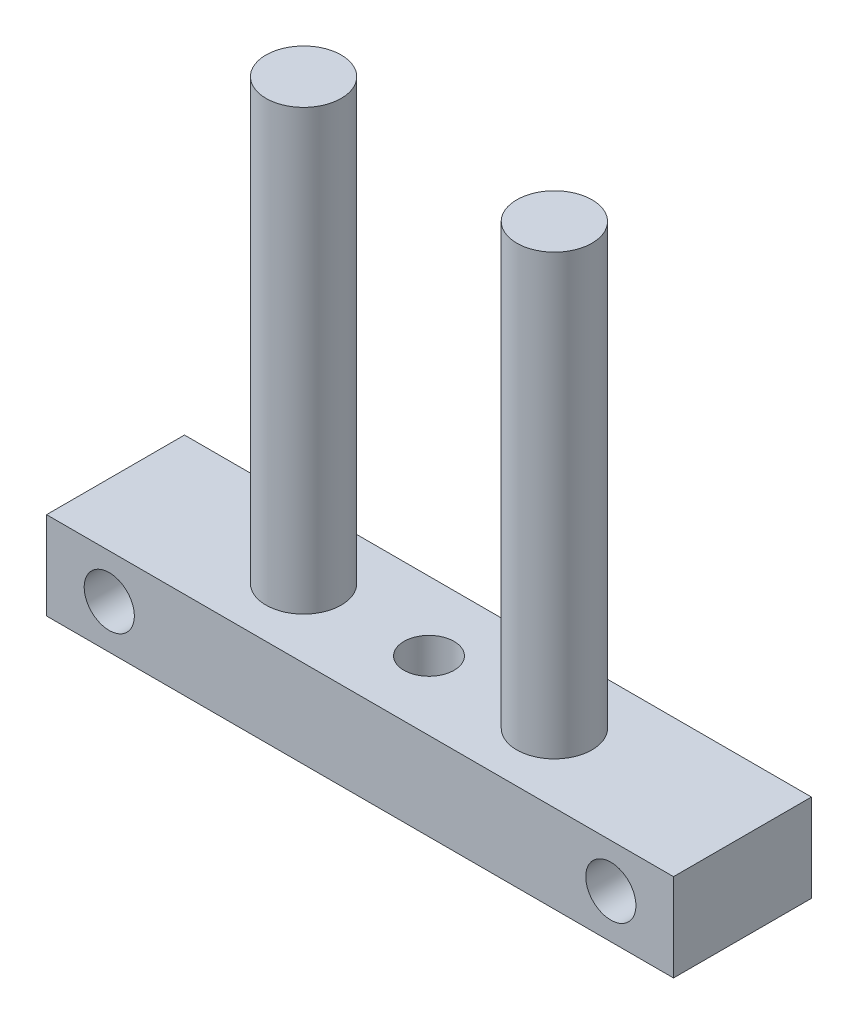
ISO-10303-21;
HEADER;
FILE_DESCRIPTION(('STEP AP214'),'2;1');
FILE_NAME('part.step','',(''),(''),'','','');
FILE_SCHEMA(('AUTOMOTIVE_DESIGN { 1 0 10303 214 1 1 1 1 }'));
ENDSEC;
DATA;
#1=APPLICATION_CONTEXT('core data for automotive mechanical design processes');
#2=APPLICATION_PROTOCOL_DEFINITION('international standard','automotive_design',2000,#1);
#3=PRODUCT_CONTEXT('',#1,'mechanical');
#4=PRODUCT('Part','Part','',(#3));
#5=PRODUCT_RELATED_PRODUCT_CATEGORY('part','',(#4));
#6=PRODUCT_DEFINITION_FORMATION('','',#4);
#7=PRODUCT_DEFINITION_CONTEXT('part definition',#1,'design');
#8=PRODUCT_DEFINITION('design','',#6,#7);
#9=PRODUCT_DEFINITION_SHAPE('','',#8);
#10=(LENGTH_UNIT() NAMED_UNIT(*) SI_UNIT(.MILLI.,.METRE.));
#11=(NAMED_UNIT(*) PLANE_ANGLE_UNIT() SI_UNIT($,.RADIAN.));
#12=(NAMED_UNIT(*) SI_UNIT($,.STERADIAN.) SOLID_ANGLE_UNIT());
#13=UNCERTAINTY_MEASURE_WITH_UNIT(LENGTH_MEASURE(1.E-05),#10,'distance_accuracy_value','');
#14=(GEOMETRIC_REPRESENTATION_CONTEXT(3) GLOBAL_UNCERTAINTY_ASSIGNED_CONTEXT((#13)) GLOBAL_UNIT_ASSIGNED_CONTEXT((#10,
#11,#12)) REPRESENTATION_CONTEXT('',''));
#15=CARTESIAN_POINT('',(0.,0.,0.));
#16=DIRECTION('',(0.,0.,1.));
#17=DIRECTION('',(1.,0.,0.));
#18=AXIS2_PLACEMENT_3D('',#15,#16,#17);
#19=CARTESIAN_POINT('',(25.,-3.5,11.));
#20=DIRECTION('',(-1.,0.,0.));
#21=DIRECTION('',(0.,0.,1.));
#22=AXIS2_PLACEMENT_3D('',#19,#20,#21);
#23=PLANE('',#22);
#24=DIRECTION('',(0.,1.,0.));
#25=VECTOR('',#24,1.);
#26=CARTESIAN_POINT('',(25.,-3.5,0.));
#27=LINE('',#26,#25);
#28=CARTESIAN_POINT('',(25.,-3.5,0.));
#29=VERTEX_POINT('',#28);
#30=CARTESIAN_POINT('',(25.,3.5,0.));
#31=VERTEX_POINT('',#30);
#32=EDGE_CURVE('E111',#29,#31,#27,.T.);
#33=ORIENTED_EDGE('',*,*,#32,.T.);
#34=DIRECTION('',(0.,0.,-1.));
#35=VECTOR('',#34,1.);
#36=CARTESIAN_POINT('',(25.,3.5,11.));
#37=LINE('',#36,#35);
#38=CARTESIAN_POINT('',(25.,3.5,11.));
#39=VERTEX_POINT('',#38);
#40=EDGE_CURVE('E100',#39,#31,#37,.T.);
#41=ORIENTED_EDGE('',*,*,#40,.F.);
#42=DIRECTION('',(0.,1.,0.));
#43=VECTOR('',#42,1.);
#44=CARTESIAN_POINT('',(25.,-3.5,11.));
#45=LINE('',#44,#43);
#46=CARTESIAN_POINT('',(25.,-3.5,11.));
#47=VERTEX_POINT('',#46);
#48=EDGE_CURVE('E92',#47,#39,#45,.T.);
#49=ORIENTED_EDGE('',*,*,#48,.F.);
#50=DIRECTION('',(0.,0.,-1.));
#51=VECTOR('',#50,1.);
#52=CARTESIAN_POINT('',(25.,-3.5,11.));
#53=LINE('',#52,#51);
#54=EDGE_CURVE('E107',#47,#29,#53,.T.);
#55=ORIENTED_EDGE('',*,*,#54,.T.);
#56=EDGE_LOOP('',(#33,#41,#49,#55));
#57=FACE_BOUND('',#56,.T.);
#58=ADVANCED_FACE('F39',(#57),#23,.F.);
#59=CARTESIAN_POINT('',(-25.,3.5,11.));
#60=DIRECTION('',(0.,-1.,0.));
#61=DIRECTION('',(0.,0.,-1.));
#62=AXIS2_PLACEMENT_3D('',#59,#60,#61);
#63=PLANE('',#62);
#64=CARTESIAN_POINT('',(-9.99999999999999,3.5,5.5));
#65=DIRECTION('',(0.,-1.,0.));
#66=DIRECTION('',(0.,0.,-1.));
#67=AXIS2_PLACEMENT_3D('',#64,#65,#66);
#68=CIRCLE('',#67,3.);
#69=CARTESIAN_POINT('',(-9.99999999999999,3.5,2.5));
#70=VERTEX_POINT('',#69);
#71=EDGE_CURVE('E11',#70,#70,#68,.F.);
#72=ORIENTED_EDGE('',*,*,#71,.F.);
#73=EDGE_LOOP('',(#72));
#74=FACE_BOUND('',#73,.T.);
#75=CARTESIAN_POINT('',(9.99999999999999,3.5,5.49999999999999));
#76=DIRECTION('',(0.,-1.,0.));
#77=DIRECTION('',(0.,0.,-1.));
#78=AXIS2_PLACEMENT_3D('',#75,#76,#77);
#79=CIRCLE('',#78,3.);
#80=CARTESIAN_POINT('',(9.99999999999999,3.5,2.49999999999999));
#81=VERTEX_POINT('',#80);
#82=EDGE_CURVE('E48',#81,#81,#79,.F.);
#83=ORIENTED_EDGE('',*,*,#82,.F.);
#84=EDGE_LOOP('',(#83));
#85=FACE_BOUND('',#84,.T.);
#86=CARTESIAN_POINT('',(0.,3.5,5.5));
#87=DIRECTION('',(0.,-1.,0.));
#88=DIRECTION('',(0.,0.,-1.));
#89=AXIS2_PLACEMENT_3D('',#86,#87,#88);
#90=CIRCLE('',#89,2.);
#91=CARTESIAN_POINT('',(0.,3.5,3.5));
#92=VERTEX_POINT('',#91);
#93=EDGE_CURVE('E138',#92,#92,#90,.T.);
#94=ORIENTED_EDGE('',*,*,#93,.T.);
#95=EDGE_LOOP('',(#94));
#96=FACE_BOUND('',#95,.T.);
#97=DIRECTION('',(-1.,0.,0.));
#98=VECTOR('',#97,1.);
#99=CARTESIAN_POINT('',(-25.,3.5,0.));
#100=LINE('',#99,#98);
#101=CARTESIAN_POINT('',(-25.,3.5,0.));
#102=VERTEX_POINT('',#101);
#103=EDGE_CURVE('E98',#31,#102,#100,.T.);
#104=ORIENTED_EDGE('',*,*,#103,.T.);
#105=DIRECTION('',(0.,0.,-1.));
#106=VECTOR('',#105,1.);
#107=CARTESIAN_POINT('',(-25.,3.5,11.));
#108=LINE('',#107,#106);
#109=CARTESIAN_POINT('',(-25.,3.5,11.));
#110=VERTEX_POINT('',#109);
#111=EDGE_CURVE('E96',#110,#102,#108,.T.);
#112=ORIENTED_EDGE('',*,*,#111,.F.);
#113=DIRECTION('',(-1.,0.,0.));
#114=VECTOR('',#113,1.);
#115=CARTESIAN_POINT('',(-25.,3.5,11.));
#116=LINE('',#115,#114);
#117=EDGE_CURVE('E87',#39,#110,#116,.T.);
#118=ORIENTED_EDGE('',*,*,#117,.F.);
#119=ORIENTED_EDGE('',*,*,#40,.T.);
#120=EDGE_LOOP('',(#104,#112,#118,#119));
#121=FACE_BOUND('',#120,.T.);
#122=ADVANCED_FACE('F97',(#74,#85,#96,#121),#63,.F.);
#123=CARTESIAN_POINT('',(-25.,-3.5,11.));
#124=DIRECTION('',(1.,0.,0.));
#125=DIRECTION('',(0.,0.,-1.));
#126=AXIS2_PLACEMENT_3D('',#123,#124,#125);
#127=PLANE('',#126);
#128=DIRECTION('',(0.,-1.,0.));
#129=VECTOR('',#128,1.);
#130=CARTESIAN_POINT('',(-25.,-3.5,0.));
#131=LINE('',#130,#129);
#132=CARTESIAN_POINT('',(-25.,-3.5,0.));
#133=VERTEX_POINT('',#132);
#134=EDGE_CURVE('E73',#102,#133,#131,.T.);
#135=ORIENTED_EDGE('',*,*,#134,.T.);
#136=DIRECTION('',(0.,0.,-1.));
#137=VECTOR('',#136,1.);
#138=CARTESIAN_POINT('',(-25.,-3.5,11.));
#139=LINE('',#138,#137);
#140=CARTESIAN_POINT('',(-25.,-3.5,11.));
#141=VERTEX_POINT('',#140);
#142=EDGE_CURVE('E101',#141,#133,#139,.T.);
#143=ORIENTED_EDGE('',*,*,#142,.F.);
#144=DIRECTION('',(0.,-1.,0.));
#145=VECTOR('',#144,1.);
#146=CARTESIAN_POINT('',(-25.,-3.5,11.));
#147=LINE('',#146,#145);
#148=EDGE_CURVE('E90',#110,#141,#147,.T.);
#149=ORIENTED_EDGE('',*,*,#148,.F.);
#150=ORIENTED_EDGE('',*,*,#111,.T.);
#151=EDGE_LOOP('',(#135,#143,#149,#150));
#152=FACE_BOUND('',#151,.T.);
#153=ADVANCED_FACE('F103',(#152),#127,.F.);
#154=CARTESIAN_POINT('',(-25.,-3.5,11.));
#155=DIRECTION('',(0.,1.,0.));
#156=DIRECTION('',(0.,0.,1.));
#157=AXIS2_PLACEMENT_3D('',#154,#155,#156);
#158=PLANE('',#157);
#159=CARTESIAN_POINT('',(0.,-3.5,5.5));
#160=DIRECTION('',(0.,-1.,0.));
#161=DIRECTION('',(0.,0.,-1.));
#162=AXIS2_PLACEMENT_3D('',#159,#160,#161);
#163=CIRCLE('',#162,2.);
#164=CARTESIAN_POINT('',(0.,-3.5,3.5));
#165=VERTEX_POINT('',#164);
#166=EDGE_CURVE('E142',#165,#165,#163,.T.);
#167=ORIENTED_EDGE('',*,*,#166,.F.);
#168=EDGE_LOOP('',(#167));
#169=FACE_BOUND('',#168,.T.);
#170=DIRECTION('',(1.,0.,0.));
#171=VECTOR('',#170,1.);
#172=CARTESIAN_POINT('',(-25.,-3.5,0.));
#173=LINE('',#172,#171);
#174=EDGE_CURVE('E79',#133,#29,#173,.T.);
#175=ORIENTED_EDGE('',*,*,#174,.T.);
#176=ORIENTED_EDGE('',*,*,#54,.F.);
#177=DIRECTION('',(1.,0.,0.));
#178=VECTOR('',#177,1.);
#179=CARTESIAN_POINT('',(-25.,-3.5,11.));
#180=LINE('',#179,#178);
#181=EDGE_CURVE('E56',#141,#47,#180,.T.);
#182=ORIENTED_EDGE('',*,*,#181,.F.);
#183=ORIENTED_EDGE('',*,*,#142,.T.);
#184=EDGE_LOOP('',(#175,#176,#182,#183));
#185=FACE_BOUND('',#184,.T.);
#186=ADVANCED_FACE('F182',(#169,#185),#158,.F.);
#187=CARTESIAN_POINT('',(0.,0.,11.));
#188=DIRECTION('',(0.,0.,-1.));
#189=DIRECTION('',(-1.,0.,0.));
#190=AXIS2_PLACEMENT_3D('',#187,#188,#189);
#191=PLANE('',#190);
#192=CARTESIAN_POINT('',(-20.,0.,11.));
#193=DIRECTION('',(0.,0.,-1.));
#194=DIRECTION('',(-1.,0.,0.));
#195=AXIS2_PLACEMENT_3D('',#192,#193,#194);
#196=CIRCLE('',#195,2.);
#197=CARTESIAN_POINT('',(-22.,0.,11.));
#198=VERTEX_POINT('',#197);
#199=EDGE_CURVE('E115',#198,#198,#196,.T.);
#200=ORIENTED_EDGE('',*,*,#199,.T.);
#201=EDGE_LOOP('',(#200));
#202=FACE_BOUND('',#201,.T.);
#203=CARTESIAN_POINT('',(20.,0.,11.));
#204=DIRECTION('',(0.,0.,-1.));
#205=DIRECTION('',(1.,0.,0.));
#206=AXIS2_PLACEMENT_3D('',#203,#204,#205);
#207=CIRCLE('',#206,2.);
#208=CARTESIAN_POINT('',(22.,0.,11.));
#209=VERTEX_POINT('',#208);
#210=EDGE_CURVE('E147',#209,#209,#207,.T.);
#211=ORIENTED_EDGE('',*,*,#210,.T.);
#212=EDGE_LOOP('',(#211));
#213=FACE_BOUND('',#212,.T.);
#214=ORIENTED_EDGE('',*,*,#48,.T.);
#215=ORIENTED_EDGE('',*,*,#117,.T.);
#216=ORIENTED_EDGE('',*,*,#148,.T.);
#217=ORIENTED_EDGE('',*,*,#181,.T.);
#218=EDGE_LOOP('',(#214,#215,#216,#217));
#219=FACE_BOUND('',#218,.T.);
#220=ADVANCED_FACE('F88',(#202,#213,#219),#191,.F.);
#221=CARTESIAN_POINT('',(0.,0.,0.));
#222=DIRECTION('',(0.,0.,-1.));
#223=DIRECTION('',(-1.,0.,0.));
#224=AXIS2_PLACEMENT_3D('',#221,#222,#223);
#225=PLANE('',#224);
#226=CARTESIAN_POINT('',(-20.,0.,0.));
#227=DIRECTION('',(0.,0.,-1.));
#228=DIRECTION('',(-1.,0.,0.));
#229=AXIS2_PLACEMENT_3D('',#226,#227,#228);
#230=CIRCLE('',#229,2.);
#231=CARTESIAN_POINT('',(-22.,0.,0.));
#232=VERTEX_POINT('',#231);
#233=EDGE_CURVE('E158',#232,#232,#230,.T.);
#234=ORIENTED_EDGE('',*,*,#233,.F.);
#235=EDGE_LOOP('',(#234));
#236=FACE_BOUND('',#235,.T.);
#237=CARTESIAN_POINT('',(20.,0.,0.));
#238=DIRECTION('',(0.,0.,-1.));
#239=DIRECTION('',(1.,0.,0.));
#240=AXIS2_PLACEMENT_3D('',#237,#238,#239);
#241=CIRCLE('',#240,2.);
#242=CARTESIAN_POINT('',(22.,0.,0.));
#243=VERTEX_POINT('',#242);
#244=EDGE_CURVE('E141',#243,#243,#241,.T.);
#245=ORIENTED_EDGE('',*,*,#244,.F.);
#246=EDGE_LOOP('',(#245));
#247=FACE_BOUND('',#246,.T.);
#248=ORIENTED_EDGE('',*,*,#32,.F.);
#249=ORIENTED_EDGE('',*,*,#174,.F.);
#250=ORIENTED_EDGE('',*,*,#134,.F.);
#251=ORIENTED_EDGE('',*,*,#103,.F.);
#252=EDGE_LOOP('',(#248,#249,#250,#251));
#253=FACE_BOUND('',#252,.T.);
#254=ADVANCED_FACE('F172',(#236,#247,#253),#225,.T.);
#255=CARTESIAN_POINT('',(20.,0.,11.));
#256=DIRECTION('',(0.,0.,-1.));
#257=DIRECTION('',(-1.,0.,0.));
#258=AXIS2_PLACEMENT_3D('',#255,#256,#257);
#259=CYLINDRICAL_SURFACE('',#258,2.);
#260=ORIENTED_EDGE('',*,*,#210,.F.);
#261=EDGE_LOOP('',(#260));
#262=FACE_BOUND('',#261,.T.);
#263=ORIENTED_EDGE('',*,*,#244,.T.);
#264=EDGE_LOOP('',(#263));
#265=FACE_BOUND('',#264,.T.);
#266=ADVANCED_FACE('F168',(#262,#265),#259,.F.);
#267=CARTESIAN_POINT('',(-20.,0.,11.));
#268=DIRECTION('',(0.,0.,-1.));
#269=DIRECTION('',(-1.,0.,0.));
#270=AXIS2_PLACEMENT_3D('',#267,#268,#269);
#271=CYLINDRICAL_SURFACE('',#270,2.);
#272=ORIENTED_EDGE('',*,*,#199,.F.);
#273=EDGE_LOOP('',(#272));
#274=FACE_BOUND('',#273,.T.);
#275=ORIENTED_EDGE('',*,*,#233,.T.);
#276=EDGE_LOOP('',(#275));
#277=FACE_BOUND('',#276,.T.);
#278=ADVANCED_FACE('F171',(#274,#277),#271,.F.);
#279=CARTESIAN_POINT('',(0.,3.5,5.5));
#280=DIRECTION('',(0.,-1.,0.));
#281=DIRECTION('',(0.,0.,-1.));
#282=AXIS2_PLACEMENT_3D('',#279,#280,#281);
#283=CYLINDRICAL_SURFACE('',#282,2.);
#284=ORIENTED_EDGE('',*,*,#93,.F.);
#285=EDGE_LOOP('',(#284));
#286=FACE_BOUND('',#285,.T.);
#287=ORIENTED_EDGE('',*,*,#166,.T.);
#288=EDGE_LOOP('',(#287));
#289=FACE_BOUND('',#288,.T.);
#290=ADVANCED_FACE('F234',(#286,#289),#283,.F.);
#291=CARTESIAN_POINT('',(9.99999999999999,38.5,5.49999999999999));
#292=DIRECTION('',(0.,-1.,0.));
#293=DIRECTION('',(0.,0.,-1.));
#294=AXIS2_PLACEMENT_3D('',#291,#292,#293);
#295=CYLINDRICAL_SURFACE('',#294,3.);
#296=CARTESIAN_POINT('',(9.99999999999999,38.5,5.49999999999999));
#297=DIRECTION('',(0.,1.,0.));
#298=DIRECTION('',(0.,0.,-1.));
#299=AXIS2_PLACEMENT_3D('',#296,#297,#298);
#300=CIRCLE('',#299,3.);
#301=CARTESIAN_POINT('',(9.99999999999999,38.5,2.49999999999999));
#302=VERTEX_POINT('',#301);
#303=EDGE_CURVE('E150',#302,#302,#300,.T.);
#304=ORIENTED_EDGE('',*,*,#303,.F.);
#305=EDGE_LOOP('',(#304));
#306=FACE_BOUND('',#305,.T.);
#307=ORIENTED_EDGE('',*,*,#82,.T.);
#308=EDGE_LOOP('',(#307));
#309=FACE_BOUND('',#308,.T.);
#310=ADVANCED_FACE('F131',(#306,#309),#295,.T.);
#311=CARTESIAN_POINT('',(9.99999999999999,38.5,5.49999999999999));
#312=DIRECTION('',(0.,-1.,0.));
#313=DIRECTION('',(0.,0.,-1.));
#314=AXIS2_PLACEMENT_3D('',#311,#312,#313);
#315=PLANE('',#314);
#316=ORIENTED_EDGE('',*,*,#303,.T.);
#317=EDGE_LOOP('',(#316));
#318=FACE_BOUND('',#317,.T.);
#319=ADVANCED_FACE('F254',(#318),#315,.F.);
#320=CARTESIAN_POINT('',(-9.99999999999999,38.5,5.5));
#321=DIRECTION('',(0.,-1.,0.));
#322=DIRECTION('',(0.,0.,-1.));
#323=AXIS2_PLACEMENT_3D('',#320,#321,#322);
#324=CYLINDRICAL_SURFACE('',#323,3.);
#325=CARTESIAN_POINT('',(-9.99999999999999,38.5,5.5));
#326=DIRECTION('',(0.,1.,0.));
#327=DIRECTION('',(0.,0.,1.));
#328=AXIS2_PLACEMENT_3D('',#325,#326,#327);
#329=CIRCLE('',#328,3.);
#330=CARTESIAN_POINT('',(-9.99999999999999,38.5,8.5));
#331=VERTEX_POINT('',#330);
#332=EDGE_CURVE('E290',#331,#331,#329,.T.);
#333=ORIENTED_EDGE('',*,*,#332,.F.);
#334=EDGE_LOOP('',(#333));
#335=FACE_BOUND('',#334,.T.);
#336=ORIENTED_EDGE('',*,*,#71,.T.);
#337=EDGE_LOOP('',(#336));
#338=FACE_BOUND('',#337,.T.);
#339=ADVANCED_FACE('F261',(#335,#338),#324,.T.);
#340=CARTESIAN_POINT('',(-9.99999999999999,38.5,5.5));
#341=DIRECTION('',(0.,1.,0.));
#342=DIRECTION('',(0.,0.,1.));
#343=AXIS2_PLACEMENT_3D('',#340,#341,#342);
#344=PLANE('',#343);
#345=ORIENTED_EDGE('',*,*,#332,.T.);
#346=EDGE_LOOP('',(#345));
#347=FACE_BOUND('',#346,.T.);
#348=ADVANCED_FACE('F269',(#347),#344,.T.);
#349=CLOSED_SHELL('',(#58,#122,#153,#186,#220,#254,#266,#278,#290,#310,#319,#339,#348));
#350=MANIFOLD_SOLID_BREP('B2',#349);
#351=ADVANCED_BREP_SHAPE_REPRESENTATION('',(#18,#350),#14);
#352=SHAPE_DEFINITION_REPRESENTATION(#9,#351);
ENDSEC;
END-ISO-10303-21;
